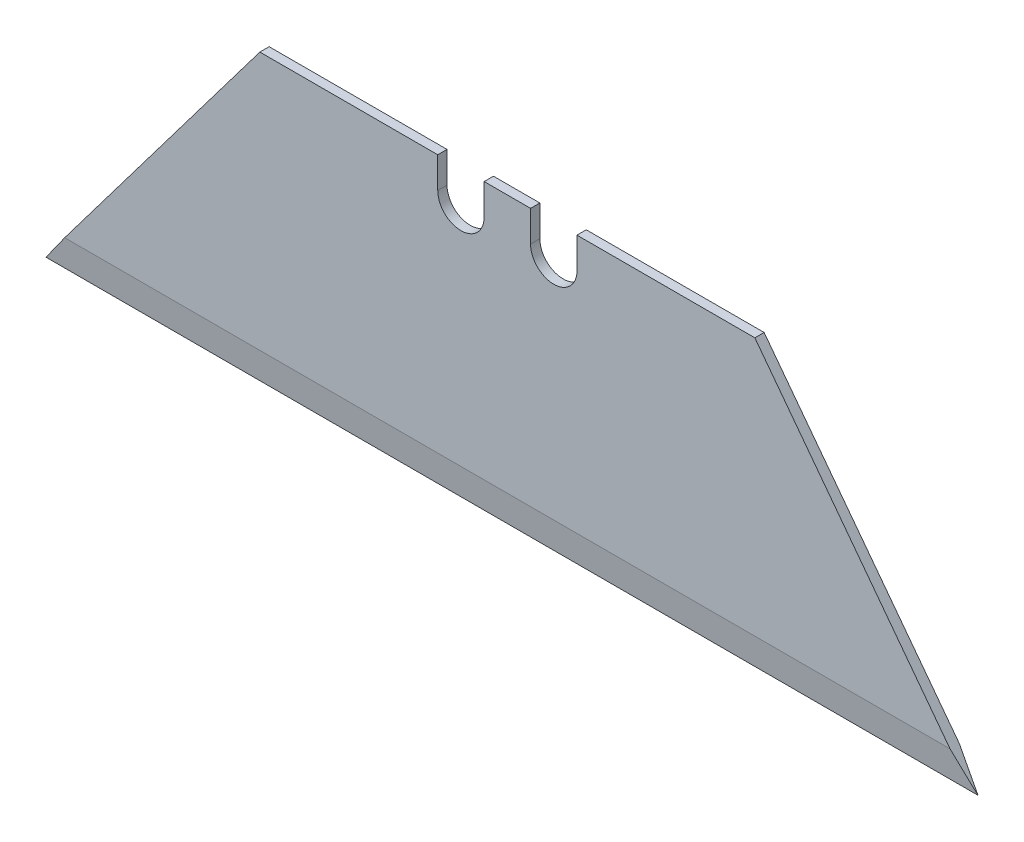
ISO-10303-21;
HEADER;
FILE_DESCRIPTION(('STEP AP214'),'2;1');
FILE_NAME('part.step','',(''),(''),'','','');
FILE_SCHEMA(('AUTOMOTIVE_DESIGN { 1 0 10303 214 1 1 1 1 }'));
ENDSEC;
DATA;
#1=APPLICATION_CONTEXT('core data for automotive mechanical design processes');
#2=APPLICATION_PROTOCOL_DEFINITION('international standard','automotive_design',2000,#1);
#3=PRODUCT_CONTEXT('',#1,'mechanical');
#4=PRODUCT('Part','Part','',(#3));
#5=PRODUCT_RELATED_PRODUCT_CATEGORY('part','',(#4));
#6=PRODUCT_DEFINITION_FORMATION('','',#4);
#7=PRODUCT_DEFINITION_CONTEXT('part definition',#1,'design');
#8=PRODUCT_DEFINITION('design','',#6,#7);
#9=PRODUCT_DEFINITION_SHAPE('','',#8);
#10=(LENGTH_UNIT() NAMED_UNIT(*) SI_UNIT(.MILLI.,.METRE.));
#11=(NAMED_UNIT(*) PLANE_ANGLE_UNIT() SI_UNIT($,.RADIAN.));
#12=(NAMED_UNIT(*) SI_UNIT($,.STERADIAN.) SOLID_ANGLE_UNIT());
#13=UNCERTAINTY_MEASURE_WITH_UNIT(LENGTH_MEASURE(1.E-05),#10,'distance_accuracy_value','');
#14=(GEOMETRIC_REPRESENTATION_CONTEXT(3) GLOBAL_UNCERTAINTY_ASSIGNED_CONTEXT((#13)) GLOBAL_UNIT_ASSIGNED_CONTEXT((#10,
#11,#12)) REPRESENTATION_CONTEXT('',''));
#15=CARTESIAN_POINT('',(0.,0.,0.));
#16=DIRECTION('',(0.,0.,1.));
#17=DIRECTION('',(1.,0.,0.));
#18=AXIS2_PLACEMENT_3D('',#15,#16,#17);
#19=CARTESIAN_POINT('',(15.0625,1.,0.15));
#20=DIRECTION('',(0.,-0.148340452930245,-0.988936352868298));
#21=DIRECTION('',(0.,0.988936352868298,-0.148340452930245));
#22=AXIS2_PLACEMENT_3D('',#19,#20,#21);
#23=PLANE('',#22);
#24=DIRECTION('',(-0.598455893562377,-0.792292050238334,0.11884380753575));
#25=VECTOR('',#24,1.);
#26=CARTESIAN_POINT('',(-28.6143048128342,1.99999999999999,0.));
#27=LINE('',#26,#25);
#28=CARTESIAN_POINT('',(-28.6143048128342,2.,0.));
#29=VERTEX_POINT('',#28);
#30=CARTESIAN_POINT('',(-30.125,0.,0.3));
#31=VERTEX_POINT('',#30);
#32=EDGE_CURVE('E184',#29,#31,#27,.T.);
#33=ORIENTED_EDGE('',*,*,#32,.F.);
#34=DIRECTION('',(1.,0.,0.));
#35=VECTOR('',#34,1.);
#36=CARTESIAN_POINT('',(0.,1.99999999999999,0.));
#37=LINE('',#36,#35);
#38=CARTESIAN_POINT('',(28.6143048128344,1.99999999999983,0.));
#39=VERTEX_POINT('',#38);
#40=EDGE_CURVE('E194',#29,#39,#37,.T.);
#41=ORIENTED_EDGE('',*,*,#40,.T.);
#42=DIRECTION('',(-0.598455893562377,0.792292050238334,-0.11884380753575));
#43=VECTOR('',#42,1.);
#44=CARTESIAN_POINT('',(30.125,0.,0.3));
#45=LINE('',#44,#43);
#46=CARTESIAN_POINT('',(30.125,0.,0.3));
#47=VERTEX_POINT('',#46);
#48=EDGE_CURVE('E193',#47,#39,#45,.T.);
#49=ORIENTED_EDGE('',*,*,#48,.F.);
#50=DIRECTION('',(1.,0.,0.));
#51=VECTOR('',#50,1.);
#52=CARTESIAN_POINT('',(15.0625,0.,0.299999999999999));
#53=LINE('',#52,#51);
#54=EDGE_CURVE('E189',#31,#47,#53,.T.);
#55=ORIENTED_EDGE('',*,*,#54,.F.);
#56=EDGE_LOOP('',(#33,#41,#49,#55));
#57=FACE_BOUND('',#56,.T.);
#58=ADVANCED_FACE('F16',(#57),#23,.T.);
#59=CARTESIAN_POINT('',(0.,8.07277570659734,0.));
#60=DIRECTION('',(0.,0.,1.));
#61=DIRECTION('',(1.,0.,0.));
#62=AXIS2_PLACEMENT_3D('',#59,#60,#61);
#63=PLANE('',#62);
#64=DIRECTION('',(-0.602727446088059,-0.797947132166139,0.));
#65=VECTOR('',#64,1.);
#66=CARTESIAN_POINT('',(-30.125,0.,0.));
#67=LINE('',#66,#65);
#68=CARTESIAN_POINT('',(-16.,18.7,0.));
#69=VERTEX_POINT('',#68);
#70=EDGE_CURVE('E177',#69,#29,#67,.T.);
#71=ORIENTED_EDGE('',*,*,#70,.F.);
#72=DIRECTION('',(1.,0.,0.));
#73=VECTOR('',#72,1.);
#74=CARTESIAN_POINT('',(-16.,18.7,0.));
#75=LINE('',#74,#73);
#76=CARTESIAN_POINT('',(-4.5,18.7,0.));
#77=VERTEX_POINT('',#76);
#78=EDGE_CURVE('E200',#77,#69,#75,.F.);
#79=ORIENTED_EDGE('',*,*,#78,.F.);
#80=DIRECTION('',(0.,1.,0.));
#81=VECTOR('',#80,1.);
#82=CARTESIAN_POINT('',(-4.5,18.7,0.));
#83=LINE('',#82,#81);
#84=CARTESIAN_POINT('',(-4.5,16.7,0.));
#85=VERTEX_POINT('',#84);
#86=EDGE_CURVE('E212',#85,#77,#83,.T.);
#87=ORIENTED_EDGE('',*,*,#86,.F.);
#88=CARTESIAN_POINT('',(-3.,16.7,0.));
#89=DIRECTION('',(0.,0.,1.));
#90=DIRECTION('',(1.,0.,0.));
#91=AXIS2_PLACEMENT_3D('',#88,#89,#90);
#92=CIRCLE('',#91,1.5);
#93=CARTESIAN_POINT('',(-1.5,16.7,0.));
#94=VERTEX_POINT('',#93);
#95=EDGE_CURVE('E227',#85,#94,#92,.T.);
#96=ORIENTED_EDGE('',*,*,#95,.T.);
#97=DIRECTION('',(0.,1.,0.));
#98=VECTOR('',#97,1.);
#99=CARTESIAN_POINT('',(-1.5,16.7,0.));
#100=LINE('',#99,#98);
#101=CARTESIAN_POINT('',(-1.5,18.7,0.));
#102=VERTEX_POINT('',#101);
#103=EDGE_CURVE('E223',#102,#94,#100,.F.);
#104=ORIENTED_EDGE('',*,*,#103,.F.);
#105=DIRECTION('',(1.,0.,0.));
#106=VECTOR('',#105,1.);
#107=CARTESIAN_POINT('',(-1.5,18.7,0.));
#108=LINE('',#107,#106);
#109=CARTESIAN_POINT('',(1.50000000000001,18.7,0.));
#110=VERTEX_POINT('',#109);
#111=EDGE_CURVE('E231',#110,#102,#108,.F.);
#112=ORIENTED_EDGE('',*,*,#111,.F.);
#113=DIRECTION('',(0.,1.,0.));
#114=VECTOR('',#113,1.);
#115=CARTESIAN_POINT('',(1.50000000000001,18.7,0.));
#116=LINE('',#115,#114);
#117=CARTESIAN_POINT('',(1.50000000000001,16.7,0.));
#118=VERTEX_POINT('',#117);
#119=EDGE_CURVE('E119',#118,#110,#116,.T.);
#120=ORIENTED_EDGE('',*,*,#119,.F.);
#121=CARTESIAN_POINT('',(3.00000000000001,16.7,0.));
#122=DIRECTION('',(0.,0.,1.));
#123=DIRECTION('',(1.,0.,0.));
#124=AXIS2_PLACEMENT_3D('',#121,#122,#123);
#125=CIRCLE('',#124,1.5);
#126=CARTESIAN_POINT('',(4.50000000000001,16.7,0.));
#127=VERTEX_POINT('',#126);
#128=EDGE_CURVE('E19',#118,#127,#125,.T.);
#129=ORIENTED_EDGE('',*,*,#128,.T.);
#130=DIRECTION('',(0.,1.,0.));
#131=VECTOR('',#130,1.);
#132=CARTESIAN_POINT('',(4.50000000000001,16.7,0.));
#133=LINE('',#132,#131);
#134=CARTESIAN_POINT('',(4.50000000000001,18.7,0.));
#135=VERTEX_POINT('',#134);
#136=EDGE_CURVE('E116',#135,#127,#133,.F.);
#137=ORIENTED_EDGE('',*,*,#136,.F.);
#138=DIRECTION('',(1.,0.,0.));
#139=VECTOR('',#138,1.);
#140=CARTESIAN_POINT('',(4.50000000000001,18.7,0.));
#141=LINE('',#140,#139);
#142=CARTESIAN_POINT('',(16.,18.7,0.));
#143=VERTEX_POINT('',#142);
#144=EDGE_CURVE('E144',#143,#135,#141,.F.);
#145=ORIENTED_EDGE('',*,*,#144,.F.);
#146=DIRECTION('',(-0.602727446088059,0.797947132166139,0.));
#147=VECTOR('',#146,1.);
#148=CARTESIAN_POINT('',(16.,18.7,0.));
#149=LINE('',#148,#147);
#150=EDGE_CURVE('E171',#39,#143,#149,.T.);
#151=ORIENTED_EDGE('',*,*,#150,.F.);
#152=ORIENTED_EDGE('',*,*,#40,.F.);
#153=EDGE_LOOP('',(#71,#79,#87,#96,#104,#112,#120,#129,#137,#145,#151,#152));
#154=FACE_BOUND('',#153,.T.);
#155=ADVANCED_FACE('F114',(#154),#63,.F.);
#156=CARTESIAN_POINT('',(15.0625,1.,0.45));
#157=DIRECTION('',(0.,-0.148340452930245,0.988936352868298));
#158=DIRECTION('',(0.,-0.988936352868298,-0.148340452930245));
#159=AXIS2_PLACEMENT_3D('',#156,#157,#158);
#160=PLANE('',#159);
#161=DIRECTION('',(0.598455893562377,-0.792292050238334,-0.11884380753575));
#162=VECTOR('',#161,1.);
#163=CARTESIAN_POINT('',(28.6143048128342,1.99999999999999,0.6));
#164=LINE('',#163,#162);
#165=CARTESIAN_POINT('',(28.6143048128342,1.99999999999999,0.6));
#166=VERTEX_POINT('',#165);
#167=EDGE_CURVE('E159',#166,#47,#164,.T.);
#168=ORIENTED_EDGE('',*,*,#167,.F.);
#169=DIRECTION('',(1.,0.,0.));
#170=VECTOR('',#169,1.);
#171=CARTESIAN_POINT('',(0.,1.99999999999999,0.6));
#172=LINE('',#171,#170);
#173=CARTESIAN_POINT('',(-28.6143048128342,1.99999999999999,0.6));
#174=VERTEX_POINT('',#173);
#175=EDGE_CURVE('E165',#174,#166,#172,.T.);
#176=ORIENTED_EDGE('',*,*,#175,.F.);
#177=DIRECTION('',(0.598455893562377,0.792292050238334,0.11884380753575));
#178=VECTOR('',#177,1.);
#179=CARTESIAN_POINT('',(-30.125,0.,0.3));
#180=LINE('',#179,#178);
#181=EDGE_CURVE('E180',#31,#174,#180,.T.);
#182=ORIENTED_EDGE('',*,*,#181,.F.);
#183=ORIENTED_EDGE('',*,*,#54,.T.);
#184=EDGE_LOOP('',(#168,#176,#182,#183));
#185=FACE_BOUND('',#184,.T.);
#186=ADVANCED_FACE('F403',(#185),#160,.T.);
#187=CARTESIAN_POINT('',(16.,18.7,0.));
#188=DIRECTION('',(0.797947132166139,0.602727446088059,0.));
#189=DIRECTION('',(-0.602727446088059,0.797947132166139,0.));
#190=AXIS2_PLACEMENT_3D('',#187,#188,#189);
#191=PLANE('',#190);
#192=DIRECTION('',(-0.602727446088059,0.797947132166139,0.));
#193=VECTOR('',#192,1.);
#194=CARTESIAN_POINT('',(28.6143048128342,2.,0.6));
#195=LINE('',#194,#193);
#196=CARTESIAN_POINT('',(16.,18.7,0.6));
#197=VERTEX_POINT('',#196);
#198=EDGE_CURVE('E152',#166,#197,#195,.T.);
#199=ORIENTED_EDGE('',*,*,#198,.F.);
#200=ORIENTED_EDGE('',*,*,#167,.T.);
#201=ORIENTED_EDGE('',*,*,#48,.T.);
#202=ORIENTED_EDGE('',*,*,#150,.T.);
#203=DIRECTION('',(0.,0.,1.));
#204=VECTOR('',#203,1.);
#205=CARTESIAN_POINT('',(16.,18.7,0.));
#206=LINE('',#205,#204);
#207=EDGE_CURVE('E155',#197,#143,#206,.F.);
#208=ORIENTED_EDGE('',*,*,#207,.F.);
#209=EDGE_LOOP('',(#199,#200,#201,#202,#208));
#210=FACE_BOUND('',#209,.T.);
#211=ADVANCED_FACE('F408',(#210),#191,.T.);
#212=CARTESIAN_POINT('',(4.50000000000001,18.7,0.));
#213=DIRECTION('',(0.,1.,0.));
#214=DIRECTION('',(0.,0.,1.));
#215=AXIS2_PLACEMENT_3D('',#212,#213,#214);
#216=PLANE('',#215);
#217=ORIENTED_EDGE('',*,*,#144,.T.);
#218=DIRECTION('',(0.,0.,1.));
#219=VECTOR('',#218,1.);
#220=CARTESIAN_POINT('',(4.50000000000001,18.7,0.));
#221=LINE('',#220,#219);
#222=CARTESIAN_POINT('',(4.50000000000001,18.7,0.6));
#223=VERTEX_POINT('',#222);
#224=EDGE_CURVE('E127',#223,#135,#221,.F.);
#225=ORIENTED_EDGE('',*,*,#224,.F.);
#226=DIRECTION('',(1.,0.,0.));
#227=VECTOR('',#226,1.);
#228=CARTESIAN_POINT('',(0.,18.7,0.6));
#229=LINE('',#228,#227);
#230=EDGE_CURVE('E147',#197,#223,#229,.F.);
#231=ORIENTED_EDGE('',*,*,#230,.F.);
#232=ORIENTED_EDGE('',*,*,#207,.T.);
#233=EDGE_LOOP('',(#217,#225,#231,#232));
#234=FACE_BOUND('',#233,.T.);
#235=ADVANCED_FACE('F422',(#234),#216,.T.);
#236=CARTESIAN_POINT('',(4.50000000000001,16.7,0.));
#237=DIRECTION('',(-1.,0.,0.));
#238=DIRECTION('',(0.,0.,1.));
#239=AXIS2_PLACEMENT_3D('',#236,#237,#238);
#240=PLANE('',#239);
#241=ORIENTED_EDGE('',*,*,#136,.T.);
#242=DIRECTION('',(0.,0.,1.));
#243=VECTOR('',#242,1.);
#244=CARTESIAN_POINT('',(4.50000000000001,16.7,0.));
#245=LINE('',#244,#243);
#246=CARTESIAN_POINT('',(4.50000000000001,16.7,0.6));
#247=VERTEX_POINT('',#246);
#248=EDGE_CURVE('E122',#127,#247,#245,.T.);
#249=ORIENTED_EDGE('',*,*,#248,.T.);
#250=DIRECTION('',(0.,1.,0.));
#251=VECTOR('',#250,1.);
#252=CARTESIAN_POINT('',(4.50000000000001,8.07277570659734,0.6));
#253=LINE('',#252,#251);
#254=EDGE_CURVE('E151',#223,#247,#253,.F.);
#255=ORIENTED_EDGE('',*,*,#254,.F.);
#256=ORIENTED_EDGE('',*,*,#224,.T.);
#257=EDGE_LOOP('',(#241,#249,#255,#256));
#258=FACE_BOUND('',#257,.T.);
#259=ADVANCED_FACE('F124',(#258),#240,.T.);
#260=CARTESIAN_POINT('',(3.00000000000001,16.7,0.));
#261=DIRECTION('',(0.,0.,1.));
#262=DIRECTION('',(1.,0.,0.));
#263=AXIS2_PLACEMENT_3D('',#260,#261,#262);
#264=CYLINDRICAL_SURFACE('',#263,1.5);
#265=ORIENTED_EDGE('',*,*,#248,.F.);
#266=ORIENTED_EDGE('',*,*,#128,.F.);
#267=DIRECTION('',(0.,0.,-1.));
#268=VECTOR('',#267,1.);
#269=CARTESIAN_POINT('',(1.50000000000001,16.7,0.));
#270=LINE('',#269,#268);
#271=CARTESIAN_POINT('',(1.50000000000001,16.7,0.6));
#272=VERTEX_POINT('',#271);
#273=EDGE_CURVE('E135',#272,#118,#270,.T.);
#274=ORIENTED_EDGE('',*,*,#273,.F.);
#275=CARTESIAN_POINT('',(3.00000000000001,16.7,0.6));
#276=DIRECTION('',(0.,0.,1.));
#277=DIRECTION('',(1.,0.,0.));
#278=AXIS2_PLACEMENT_3D('',#275,#276,#277);
#279=CIRCLE('',#278,1.5);
#280=EDGE_CURVE('E132',#247,#272,#279,.F.);
#281=ORIENTED_EDGE('',*,*,#280,.F.);
#282=EDGE_LOOP('',(#265,#266,#274,#281));
#283=FACE_BOUND('',#282,.T.);
#284=ADVANCED_FACE('F130',(#283),#264,.F.);
#285=CARTESIAN_POINT('',(1.50000000000001,18.7,0.));
#286=DIRECTION('',(1.,0.,0.));
#287=DIRECTION('',(0.,0.,-1.));
#288=AXIS2_PLACEMENT_3D('',#285,#286,#287);
#289=PLANE('',#288);
#290=ORIENTED_EDGE('',*,*,#119,.T.);
#291=DIRECTION('',(0.,0.,1.));
#292=VECTOR('',#291,1.);
#293=CARTESIAN_POINT('',(1.50000000000001,18.7,0.));
#294=LINE('',#293,#292);
#295=CARTESIAN_POINT('',(1.50000000000001,18.7,0.6));
#296=VERTEX_POINT('',#295);
#297=EDGE_CURVE('E234',#296,#110,#294,.F.);
#298=ORIENTED_EDGE('',*,*,#297,.F.);
#299=DIRECTION('',(0.,1.,0.));
#300=VECTOR('',#299,1.);
#301=CARTESIAN_POINT('',(1.50000000000001,8.07277570659734,0.6));
#302=LINE('',#301,#300);
#303=EDGE_CURVE('E263',#272,#296,#302,.T.);
#304=ORIENTED_EDGE('',*,*,#303,.F.);
#305=ORIENTED_EDGE('',*,*,#273,.T.);
#306=EDGE_LOOP('',(#290,#298,#304,#305));
#307=FACE_BOUND('',#306,.T.);
#308=ADVANCED_FACE('F301',(#307),#289,.T.);
#309=CARTESIAN_POINT('',(-1.5,18.7,0.));
#310=DIRECTION('',(0.,1.,0.));
#311=DIRECTION('',(0.,0.,1.));
#312=AXIS2_PLACEMENT_3D('',#309,#310,#311);
#313=PLANE('',#312);
#314=ORIENTED_EDGE('',*,*,#111,.T.);
#315=DIRECTION('',(0.,0.,1.));
#316=VECTOR('',#315,1.);
#317=CARTESIAN_POINT('',(-1.5,18.7,0.));
#318=LINE('',#317,#316);
#319=CARTESIAN_POINT('',(-1.5,18.7,0.6));
#320=VERTEX_POINT('',#319);
#321=EDGE_CURVE('E228',#320,#102,#318,.F.);
#322=ORIENTED_EDGE('',*,*,#321,.F.);
#323=DIRECTION('',(1.,0.,0.));
#324=VECTOR('',#323,1.);
#325=CARTESIAN_POINT('',(0.,18.7,0.6));
#326=LINE('',#325,#324);
#327=EDGE_CURVE('E286',#296,#320,#326,.F.);
#328=ORIENTED_EDGE('',*,*,#327,.F.);
#329=ORIENTED_EDGE('',*,*,#297,.T.);
#330=EDGE_LOOP('',(#314,#322,#328,#329));
#331=FACE_BOUND('',#330,.T.);
#332=ADVANCED_FACE('F297',(#331),#313,.T.);
#333=CARTESIAN_POINT('',(-1.5,16.7,0.));
#334=DIRECTION('',(-1.,0.,0.));
#335=DIRECTION('',(0.,0.,1.));
#336=AXIS2_PLACEMENT_3D('',#333,#334,#335);
#337=PLANE('',#336);
#338=ORIENTED_EDGE('',*,*,#103,.T.);
#339=DIRECTION('',(0.,0.,1.));
#340=VECTOR('',#339,1.);
#341=CARTESIAN_POINT('',(-1.5,16.7,0.));
#342=LINE('',#341,#340);
#343=CARTESIAN_POINT('',(-1.5,16.7,0.6));
#344=VERTEX_POINT('',#343);
#345=EDGE_CURVE('E265',#94,#344,#342,.T.);
#346=ORIENTED_EDGE('',*,*,#345,.T.);
#347=DIRECTION('',(0.,1.,0.));
#348=VECTOR('',#347,1.);
#349=CARTESIAN_POINT('',(-1.5,8.07277570659734,0.6));
#350=LINE('',#349,#348);
#351=EDGE_CURVE('E261',#320,#344,#350,.F.);
#352=ORIENTED_EDGE('',*,*,#351,.F.);
#353=ORIENTED_EDGE('',*,*,#321,.T.);
#354=EDGE_LOOP('',(#338,#346,#352,#353));
#355=FACE_BOUND('',#354,.T.);
#356=ADVANCED_FACE('F302',(#355),#337,.T.);
#357=CARTESIAN_POINT('',(-3.,16.7,0.));
#358=DIRECTION('',(0.,0.,1.));
#359=DIRECTION('',(1.,0.,0.));
#360=AXIS2_PLACEMENT_3D('',#357,#358,#359);
#361=CYLINDRICAL_SURFACE('',#360,1.5);
#362=ORIENTED_EDGE('',*,*,#345,.F.);
#363=ORIENTED_EDGE('',*,*,#95,.F.);
#364=DIRECTION('',(0.,0.,-1.));
#365=VECTOR('',#364,1.);
#366=CARTESIAN_POINT('',(-4.5,16.7,0.));
#367=LINE('',#366,#365);
#368=CARTESIAN_POINT('',(-4.5,16.7,0.6));
#369=VERTEX_POINT('',#368);
#370=EDGE_CURVE('E216',#369,#85,#367,.T.);
#371=ORIENTED_EDGE('',*,*,#370,.F.);
#372=CARTESIAN_POINT('',(-3.,16.7,0.6));
#373=DIRECTION('',(0.,0.,1.));
#374=DIRECTION('',(1.,0.,0.));
#375=AXIS2_PLACEMENT_3D('',#372,#373,#374);
#376=CIRCLE('',#375,1.5);
#377=EDGE_CURVE('E256',#344,#369,#376,.F.);
#378=ORIENTED_EDGE('',*,*,#377,.F.);
#379=EDGE_LOOP('',(#362,#363,#371,#378));
#380=FACE_BOUND('',#379,.T.);
#381=ADVANCED_FACE('F345',(#380),#361,.F.);
#382=CARTESIAN_POINT('',(-4.5,18.7,0.));
#383=DIRECTION('',(1.,0.,0.));
#384=DIRECTION('',(0.,0.,-1.));
#385=AXIS2_PLACEMENT_3D('',#382,#383,#384);
#386=PLANE('',#385);
#387=ORIENTED_EDGE('',*,*,#86,.T.);
#388=DIRECTION('',(0.,0.,1.));
#389=VECTOR('',#388,1.);
#390=CARTESIAN_POINT('',(-4.5,18.7,0.));
#391=LINE('',#390,#389);
#392=CARTESIAN_POINT('',(-4.5,18.7,0.6));
#393=VERTEX_POINT('',#392);
#394=EDGE_CURVE('E215',#393,#77,#391,.F.);
#395=ORIENTED_EDGE('',*,*,#394,.F.);
#396=DIRECTION('',(0.,1.,0.));
#397=VECTOR('',#396,1.);
#398=CARTESIAN_POINT('',(-4.5,8.07277570659734,0.6));
#399=LINE('',#398,#397);
#400=EDGE_CURVE('E260',#369,#393,#399,.T.);
#401=ORIENTED_EDGE('',*,*,#400,.F.);
#402=ORIENTED_EDGE('',*,*,#370,.T.);
#403=EDGE_LOOP('',(#387,#395,#401,#402));
#404=FACE_BOUND('',#403,.T.);
#405=ADVANCED_FACE('F332',(#404),#386,.T.);
#406=CARTESIAN_POINT('',(-16.,18.7,0.));
#407=DIRECTION('',(0.,1.,0.));
#408=DIRECTION('',(0.,0.,1.));
#409=AXIS2_PLACEMENT_3D('',#406,#407,#408);
#410=PLANE('',#409);
#411=ORIENTED_EDGE('',*,*,#78,.T.);
#412=DIRECTION('',(0.,0.,1.));
#413=VECTOR('',#412,1.);
#414=CARTESIAN_POINT('',(-16.,18.7,0.));
#415=LINE('',#414,#413);
#416=CARTESIAN_POINT('',(-16.,18.7,0.6));
#417=VERTEX_POINT('',#416);
#418=EDGE_CURVE('E35',#417,#69,#415,.F.);
#419=ORIENTED_EDGE('',*,*,#418,.F.);
#420=DIRECTION('',(1.,0.,0.));
#421=VECTOR('',#420,1.);
#422=CARTESIAN_POINT('',(0.,18.7,0.6));
#423=LINE('',#422,#421);
#424=EDGE_CURVE('E26',#393,#417,#423,.F.);
#425=ORIENTED_EDGE('',*,*,#424,.F.);
#426=ORIENTED_EDGE('',*,*,#394,.T.);
#427=EDGE_LOOP('',(#411,#419,#425,#426));
#428=FACE_BOUND('',#427,.T.);
#429=ADVANCED_FACE('F327',(#428),#410,.T.);
#430=CARTESIAN_POINT('',(-30.125,0.,0.));
#431=DIRECTION('',(-0.797947132166139,0.602727446088059,0.));
#432=DIRECTION('',(-0.602727446088059,-0.797947132166139,0.));
#433=AXIS2_PLACEMENT_3D('',#430,#431,#432);
#434=PLANE('',#433);
#435=ORIENTED_EDGE('',*,*,#418,.T.);
#436=ORIENTED_EDGE('',*,*,#70,.T.);
#437=ORIENTED_EDGE('',*,*,#32,.T.);
#438=ORIENTED_EDGE('',*,*,#181,.T.);
#439=DIRECTION('',(-0.602727446088059,-0.797947132166139,0.));
#440=VECTOR('',#439,1.);
#441=CARTESIAN_POINT('',(-16.,18.7,0.6));
#442=LINE('',#441,#440);
#443=EDGE_CURVE('E10',#417,#174,#442,.T.);
#444=ORIENTED_EDGE('',*,*,#443,.F.);
#445=EDGE_LOOP('',(#435,#436,#437,#438,#444));
#446=FACE_BOUND('',#445,.T.);
#447=ADVANCED_FACE('F336',(#446),#434,.T.);
#448=CARTESIAN_POINT('',(0.,8.07277570659734,0.6));
#449=DIRECTION('',(0.,0.,1.));
#450=DIRECTION('',(1.,0.,0.));
#451=AXIS2_PLACEMENT_3D('',#448,#449,#450);
#452=PLANE('',#451);
#453=ORIENTED_EDGE('',*,*,#424,.T.);
#454=ORIENTED_EDGE('',*,*,#443,.T.);
#455=ORIENTED_EDGE('',*,*,#175,.T.);
#456=ORIENTED_EDGE('',*,*,#198,.T.);
#457=ORIENTED_EDGE('',*,*,#230,.T.);
#458=ORIENTED_EDGE('',*,*,#254,.T.);
#459=ORIENTED_EDGE('',*,*,#280,.T.);
#460=ORIENTED_EDGE('',*,*,#303,.T.);
#461=ORIENTED_EDGE('',*,*,#327,.T.);
#462=ORIENTED_EDGE('',*,*,#351,.T.);
#463=ORIENTED_EDGE('',*,*,#377,.T.);
#464=ORIENTED_EDGE('',*,*,#400,.T.);
#465=EDGE_LOOP('',(#453,#454,#455,#456,#457,#458,#459,#460,#461,#462,#463,#464));
#466=FACE_BOUND('',#465,.T.);
#467=ADVANCED_FACE('F308',(#466),#452,.T.);
#468=CLOSED_SHELL('',(#58,#155,#186,#211,#235,#259,#284,#308,#332,#356,#381,#405,#429,#447,#467));
#469=MANIFOLD_SOLID_BREP('B1',#468);
#470=ADVANCED_BREP_SHAPE_REPRESENTATION('',(#18,#469),#14);
#471=SHAPE_DEFINITION_REPRESENTATION(#9,#470);
ENDSEC;
END-ISO-10303-21;
